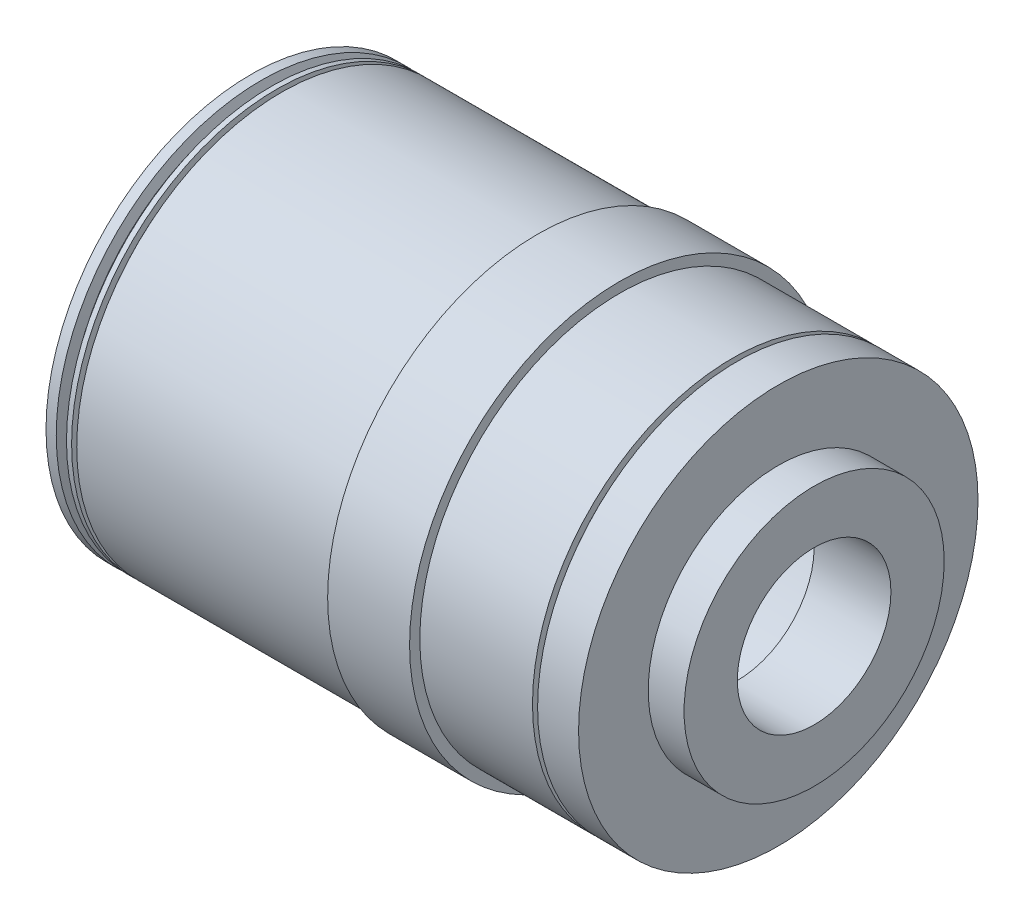
ISO-10303-21;
HEADER;
FILE_DESCRIPTION(('STEP AP214'),'2;1');
FILE_NAME('part.step','',(''),(''),'','','');
FILE_SCHEMA(('AUTOMOTIVE_DESIGN { 1 0 10303 214 1 1 1 1 }'));
ENDSEC;
DATA;
#1=APPLICATION_CONTEXT('core data for automotive mechanical design processes');
#2=APPLICATION_PROTOCOL_DEFINITION('international standard','automotive_design',2000,#1);
#3=PRODUCT_CONTEXT('',#1,'mechanical');
#4=PRODUCT('Part','Part','',(#3));
#5=PRODUCT_RELATED_PRODUCT_CATEGORY('part','',(#4));
#6=PRODUCT_DEFINITION_FORMATION('','',#4);
#7=PRODUCT_DEFINITION_CONTEXT('part definition',#1,'design');
#8=PRODUCT_DEFINITION('design','',#6,#7);
#9=PRODUCT_DEFINITION_SHAPE('','',#8);
#10=(LENGTH_UNIT() NAMED_UNIT(*) SI_UNIT(.MILLI.,.METRE.));
#11=(NAMED_UNIT(*) PLANE_ANGLE_UNIT() SI_UNIT($,.RADIAN.));
#12=(NAMED_UNIT(*) SI_UNIT($,.STERADIAN.) SOLID_ANGLE_UNIT());
#13=UNCERTAINTY_MEASURE_WITH_UNIT(LENGTH_MEASURE(1.E-05),#10,'distance_accuracy_value','');
#14=(GEOMETRIC_REPRESENTATION_CONTEXT(3) GLOBAL_UNCERTAINTY_ASSIGNED_CONTEXT((#13)) GLOBAL_UNIT_ASSIGNED_CONTEXT((#10,
#11,#12)) REPRESENTATION_CONTEXT('',''));
#15=CARTESIAN_POINT('',(0.,0.,0.));
#16=DIRECTION('',(0.,0.,1.));
#17=DIRECTION('',(1.,0.,0.));
#18=AXIS2_PLACEMENT_3D('',#15,#16,#17);
#19=CARTESIAN_POINT('',(-11.5,0.,0.));
#20=DIRECTION('',(1.,0.,0.));
#21=DIRECTION('',(0.,0.,-1.));
#22=AXIS2_PLACEMENT_3D('',#19,#20,#21);
#23=CYLINDRICAL_SURFACE('',#22,17.);
#24=CARTESIAN_POINT('',(0.,0.,0.));
#25=DIRECTION('',(-1.,0.,0.));
#26=DIRECTION('',(0.,0.,1.));
#27=AXIS2_PLACEMENT_3D('',#24,#25,#26);
#28=CIRCLE('',#27,17.);
#29=CARTESIAN_POINT('',(0.,0.,17.));
#30=VERTEX_POINT('',#29);
#31=EDGE_CURVE('E117',#30,#30,#28,.T.);
#32=ORIENTED_EDGE('',*,*,#31,.F.);
#33=EDGE_LOOP('',(#32));
#34=FACE_BOUND('',#33,.T.);
#35=CARTESIAN_POINT('',(-14.5,0.,0.));
#36=DIRECTION('',(-1.,0.,0.));
#37=DIRECTION('',(0.,0.,1.));
#38=AXIS2_PLACEMENT_3D('',#35,#36,#37);
#39=CIRCLE('',#38,17.);
#40=CARTESIAN_POINT('',(-14.5,0.,17.));
#41=VERTEX_POINT('',#40);
#42=EDGE_CURVE('E53',#41,#41,#39,.T.);
#43=ORIENTED_EDGE('',*,*,#42,.T.);
#44=EDGE_LOOP('',(#43));
#45=FACE_BOUND('',#44,.T.);
#46=ADVANCED_FACE('F36',(#34,#45),#23,.F.);
#47=CARTESIAN_POINT('',(4.,0.,0.));
#48=DIRECTION('',(1.,0.,0.));
#49=DIRECTION('',(0.,0.,-1.));
#50=AXIS2_PLACEMENT_3D('',#47,#48,#49);
#51=PLANE('',#50);
#52=CARTESIAN_POINT('',(4.,0.,0.));
#53=DIRECTION('',(1.,0.,0.));
#54=DIRECTION('',(0.,0.,-1.));
#55=AXIS2_PLACEMENT_3D('',#52,#53,#54);
#56=CIRCLE('',#55,19.5);
#57=CARTESIAN_POINT('',(4.,0.,-19.5));
#58=VERTEX_POINT('',#57);
#59=EDGE_CURVE('E40',#58,#58,#56,.T.);
#60=ORIENTED_EDGE('',*,*,#59,.T.);
#61=EDGE_LOOP('',(#60));
#62=FACE_BOUND('',#61,.T.);
#63=CARTESIAN_POINT('',(4.,0.,0.));
#64=DIRECTION('',(1.,0.,0.));
#65=DIRECTION('',(0.,0.,-1.));
#66=AXIS2_PLACEMENT_3D('',#63,#64,#65);
#67=CIRCLE('',#66,12.7);
#68=CARTESIAN_POINT('',(4.,0.,-12.7));
#69=VERTEX_POINT('',#68);
#70=EDGE_CURVE('E60',#69,#69,#67,.T.);
#71=ORIENTED_EDGE('',*,*,#70,.F.);
#72=EDGE_LOOP('',(#71));
#73=FACE_BOUND('',#72,.T.);
#74=ADVANCED_FACE('F152',(#62,#73),#51,.T.);
#75=CARTESIAN_POINT('',(-47.5,0.,0.));
#76=DIRECTION('',(1.,0.,0.));
#77=DIRECTION('',(0.,0.,-1.));
#78=AXIS2_PLACEMENT_3D('',#75,#76,#77);
#79=CYLINDRICAL_SURFACE('',#78,20.);
#80=CARTESIAN_POINT('',(-45.5,0.,0.));
#81=DIRECTION('',(-1.,0.,0.));
#82=DIRECTION('',(0.,0.,1.));
#83=AXIS2_PLACEMENT_3D('',#80,#81,#82);
#84=CIRCLE('',#83,20.);
#85=CARTESIAN_POINT('',(-45.5,0.,20.));
#86=VERTEX_POINT('',#85);
#87=EDGE_CURVE('E87',#86,#86,#84,.T.);
#88=ORIENTED_EDGE('',*,*,#87,.F.);
#89=EDGE_LOOP('',(#88));
#90=FACE_BOUND('',#89,.T.);
#91=CARTESIAN_POINT('',(-45.,0.,0.));
#92=DIRECTION('',(-1.,0.,0.));
#93=DIRECTION('',(0.,0.,1.));
#94=AXIS2_PLACEMENT_3D('',#91,#92,#93);
#95=CIRCLE('',#94,20.);
#96=CARTESIAN_POINT('',(-45.,0.,20.));
#97=VERTEX_POINT('',#96);
#98=EDGE_CURVE('E69',#97,#97,#95,.T.);
#99=ORIENTED_EDGE('',*,*,#98,.T.);
#100=EDGE_LOOP('',(#99));
#101=FACE_BOUND('',#100,.T.);
#102=ADVANCED_FACE('F158',(#90,#101),#79,.T.);
#103=CARTESIAN_POINT('',(-47.5,0.,0.));
#104=DIRECTION('',(-1.,0.,0.));
#105=DIRECTION('',(0.,0.,1.));
#106=AXIS2_PLACEMENT_3D('',#103,#104,#105);
#107=CIRCLE('',#106,20.);
#108=CARTESIAN_POINT('',(-47.5,0.,20.));
#109=VERTEX_POINT('',#108);
#110=EDGE_CURVE('E94',#109,#109,#107,.T.);
#111=ORIENTED_EDGE('',*,*,#110,.F.);
#112=EDGE_LOOP('',(#111));
#113=FACE_BOUND('',#112,.T.);
#114=CARTESIAN_POINT('',(-46.5,0.,0.));
#115=DIRECTION('',(-1.,0.,0.));
#116=DIRECTION('',(0.,0.,1.));
#117=AXIS2_PLACEMENT_3D('',#114,#115,#116);
#118=CIRCLE('',#117,20.);
#119=CARTESIAN_POINT('',(-46.5,0.,20.));
#120=VERTEX_POINT('',#119);
#121=EDGE_CURVE('E84',#120,#120,#118,.T.);
#122=ORIENTED_EDGE('',*,*,#121,.T.);
#123=EDGE_LOOP('',(#122));
#124=FACE_BOUND('',#123,.T.);
#125=ADVANCED_FACE('F183',(#113,#124),#79,.T.);
#126=CARTESIAN_POINT('',(4.,0.,0.));
#127=DIRECTION('',(-1.,0.,0.));
#128=DIRECTION('',(0.,0.,1.));
#129=AXIS2_PLACEMENT_3D('',#126,#127,#128);
#130=CYLINDRICAL_SURFACE('',#129,19.5);
#131=ORIENTED_EDGE('',*,*,#59,.F.);
#132=EDGE_LOOP('',(#131));
#133=FACE_BOUND('',#132,.T.);
#134=CARTESIAN_POINT('',(0.,0.,0.));
#135=DIRECTION('',(-1.,0.,0.));
#136=DIRECTION('',(0.,0.,1.));
#137=AXIS2_PLACEMENT_3D('',#134,#135,#136);
#138=CIRCLE('',#137,19.5);
#139=CARTESIAN_POINT('',(0.,0.,19.5));
#140=VERTEX_POINT('',#139);
#141=EDGE_CURVE('E114',#140,#140,#138,.T.);
#142=ORIENTED_EDGE('',*,*,#141,.F.);
#143=EDGE_LOOP('',(#142));
#144=FACE_BOUND('',#143,.T.);
#145=ADVANCED_FACE('F38',(#133,#144),#130,.T.);
#146=CARTESIAN_POINT('',(-11.5,0.,0.));
#147=DIRECTION('',(-1.,0.,0.));
#148=DIRECTION('',(0.,0.,1.));
#149=AXIS2_PLACEMENT_3D('',#146,#147,#148);
#150=CIRCLE('',#149,19.5);
#151=CARTESIAN_POINT('',(-11.5,0.,19.5));
#152=VERTEX_POINT('',#151);
#153=EDGE_CURVE('E120',#152,#152,#150,.T.);
#154=ORIENTED_EDGE('',*,*,#153,.F.);
#155=EDGE_LOOP('',(#154));
#156=FACE_BOUND('',#155,.T.);
#157=CARTESIAN_POINT('',(-0.5,0.,0.));
#158=DIRECTION('',(-1.,0.,0.));
#159=DIRECTION('',(0.,0.,1.));
#160=AXIS2_PLACEMENT_3D('',#157,#158,#159);
#161=CIRCLE('',#160,19.5);
#162=CARTESIAN_POINT('',(-0.5,0.,19.5));
#163=VERTEX_POINT('',#162);
#164=EDGE_CURVE('E111',#163,#163,#161,.T.);
#165=ORIENTED_EDGE('',*,*,#164,.T.);
#166=EDGE_LOOP('',(#165));
#167=FACE_BOUND('',#166,.T.);
#168=ADVANCED_FACE('F231',(#156,#167),#130,.T.);
#169=CARTESIAN_POINT('',(0.,0.,0.));
#170=DIRECTION('',(1.,0.,0.));
#171=DIRECTION('',(0.,0.,-1.));
#172=AXIS2_PLACEMENT_3D('',#169,#170,#171);
#173=PLANE('',#172);
#174=ORIENTED_EDGE('',*,*,#31,.T.);
#175=EDGE_LOOP('',(#174));
#176=FACE_BOUND('',#175,.T.);
#177=CARTESIAN_POINT('',(0.,0.,0.));
#178=DIRECTION('',(1.,0.,0.));
#179=DIRECTION('',(0.,0.,-1.));
#180=AXIS2_PLACEMENT_3D('',#177,#178,#179);
#181=CIRCLE('',#180,7.5);
#182=CARTESIAN_POINT('',(0.,0.,-7.5));
#183=VERTEX_POINT('',#182);
#184=EDGE_CURVE('E48',#183,#183,#181,.T.);
#185=ORIENTED_EDGE('',*,*,#184,.T.);
#186=EDGE_LOOP('',(#185));
#187=FACE_BOUND('',#186,.T.);
#188=ADVANCED_FACE('F125',(#176,#187),#173,.F.);
#189=CARTESIAN_POINT('',(4.,0.,0.));
#190=DIRECTION('',(-1.,0.,0.));
#191=DIRECTION('',(0.,0.,1.));
#192=AXIS2_PLACEMENT_3D('',#189,#190,#191);
#193=CYLINDRICAL_SURFACE('',#192,7.5);
#194=ORIENTED_EDGE('',*,*,#184,.F.);
#195=EDGE_LOOP('',(#194));
#196=FACE_BOUND('',#195,.T.);
#197=CARTESIAN_POINT('',(7.5,0.,0.));
#198=DIRECTION('',(1.,0.,0.));
#199=DIRECTION('',(0.,0.,-1.));
#200=AXIS2_PLACEMENT_3D('',#197,#198,#199);
#201=CIRCLE('',#200,7.5);
#202=CARTESIAN_POINT('',(7.5,0.,-7.5));
#203=VERTEX_POINT('',#202);
#204=EDGE_CURVE('E56',#203,#203,#201,.T.);
#205=ORIENTED_EDGE('',*,*,#204,.T.);
#206=EDGE_LOOP('',(#205));
#207=FACE_BOUND('',#206,.T.);
#208=ADVANCED_FACE('F127',(#196,#207),#193,.F.);
#209=CARTESIAN_POINT('',(-19.5,0.,0.));
#210=DIRECTION('',(-1.,0.,0.));
#211=DIRECTION('',(0.,0.,1.));
#212=AXIS2_PLACEMENT_3D('',#209,#210,#211);
#213=CIRCLE('',#212,17.);
#214=CARTESIAN_POINT('',(-19.5,0.,17.));
#215=VERTEX_POINT('',#214);
#216=EDGE_CURVE('E10',#215,#215,#213,.T.);
#217=ORIENTED_EDGE('',*,*,#216,.F.);
#218=EDGE_LOOP('',(#217));
#219=FACE_BOUND('',#218,.T.);
#220=CARTESIAN_POINT('',(-47.5,0.,0.));
#221=DIRECTION('',(-1.,0.,0.));
#222=DIRECTION('',(0.,0.,1.));
#223=AXIS2_PLACEMENT_3D('',#220,#221,#222);
#224=CIRCLE('',#223,17.);
#225=CARTESIAN_POINT('',(-47.5,0.,17.));
#226=VERTEX_POINT('',#225);
#227=EDGE_CURVE('E91',#226,#226,#224,.F.);
#228=ORIENTED_EDGE('',*,*,#227,.F.);
#229=EDGE_LOOP('',(#228));
#230=FACE_BOUND('',#229,.T.);
#231=ADVANCED_FACE('F130',(#219,#230),#23,.F.);
#232=CARTESIAN_POINT('',(0.,18.8,0.));
#233=DIRECTION('',(-1.,0.,0.));
#234=DIRECTION('',(0.,0.,1.));
#235=AXIS2_PLACEMENT_3D('',#232,#233,#234);
#236=PLANE('',#235);
#237=ORIENTED_EDGE('',*,*,#141,.T.);
#238=EDGE_LOOP('',(#237));
#239=FACE_BOUND('',#238,.T.);
#240=CARTESIAN_POINT('',(0.,0.,0.));
#241=DIRECTION('',(-1.,0.,0.));
#242=DIRECTION('',(0.,0.,1.));
#243=AXIS2_PLACEMENT_3D('',#240,#241,#242);
#244=CIRCLE('',#243,18.8);
#245=CARTESIAN_POINT('',(0.,0.,18.8));
#246=VERTEX_POINT('',#245);
#247=EDGE_CURVE('E103',#246,#246,#244,.T.);
#248=ORIENTED_EDGE('',*,*,#247,.F.);
#249=EDGE_LOOP('',(#248));
#250=FACE_BOUND('',#249,.T.);
#251=ADVANCED_FACE('F165',(#239,#250),#236,.T.);
#252=CARTESIAN_POINT('',(-0.5,19.5,0.));
#253=DIRECTION('',(1.,0.,0.));
#254=DIRECTION('',(0.,0.,-1.));
#255=AXIS2_PLACEMENT_3D('',#252,#253,#254);
#256=PLANE('',#255);
#257=CARTESIAN_POINT('',(-0.5,0.,0.));
#258=DIRECTION('',(-1.,0.,0.));
#259=DIRECTION('',(0.,0.,1.));
#260=AXIS2_PLACEMENT_3D('',#257,#258,#259);
#261=CIRCLE('',#260,18.8);
#262=CARTESIAN_POINT('',(-0.5,0.,18.8));
#263=VERTEX_POINT('',#262);
#264=EDGE_CURVE('E108',#263,#263,#261,.T.);
#265=ORIENTED_EDGE('',*,*,#264,.T.);
#266=EDGE_LOOP('',(#265));
#267=FACE_BOUND('',#266,.T.);
#268=ORIENTED_EDGE('',*,*,#164,.F.);
#269=EDGE_LOOP('',(#268));
#270=FACE_BOUND('',#269,.T.);
#271=ADVANCED_FACE('F170',(#267,#270),#256,.T.);
#272=CARTESIAN_POINT('',(-11.5,0.,0.));
#273=DIRECTION('',(-1.,0.,0.));
#274=DIRECTION('',(0.,0.,1.));
#275=AXIS2_PLACEMENT_3D('',#272,#273,#274);
#276=CYLINDRICAL_SURFACE('',#275,18.8);
#277=ORIENTED_EDGE('',*,*,#247,.T.);
#278=EDGE_LOOP('',(#277));
#279=FACE_BOUND('',#278,.T.);
#280=ORIENTED_EDGE('',*,*,#264,.F.);
#281=EDGE_LOOP('',(#280));
#282=FACE_BOUND('',#281,.T.);
#283=ADVANCED_FACE('F215',(#279,#282),#276,.T.);
#284=CARTESIAN_POINT('',(-11.5,0.,0.));
#285=DIRECTION('',(-1.,0.,0.));
#286=DIRECTION('',(0.,0.,1.));
#287=AXIS2_PLACEMENT_3D('',#284,#285,#286);
#288=PLANE('',#287);
#289=CARTESIAN_POINT('',(-11.5,0.,0.));
#290=DIRECTION('',(-1.,0.,0.));
#291=DIRECTION('',(0.,0.,1.));
#292=AXIS2_PLACEMENT_3D('',#289,#290,#291);
#293=CIRCLE('',#292,20.5);
#294=CARTESIAN_POINT('',(-11.5,0.,20.5));
#295=VERTEX_POINT('',#294);
#296=EDGE_CURVE('E97',#295,#295,#293,.T.);
#297=ORIENTED_EDGE('',*,*,#296,.F.);
#298=EDGE_LOOP('',(#297));
#299=FACE_BOUND('',#298,.T.);
#300=ORIENTED_EDGE('',*,*,#153,.T.);
#301=EDGE_LOOP('',(#300));
#302=FACE_BOUND('',#301,.T.);
#303=ADVANCED_FACE('F211',(#299,#302),#288,.F.);
#304=CARTESIAN_POINT('',(-19.5,0.,0.));
#305=DIRECTION('',(-1.,0.,0.));
#306=DIRECTION('',(0.,0.,1.));
#307=AXIS2_PLACEMENT_3D('',#304,#305,#306);
#308=PLANE('',#307);
#309=CARTESIAN_POINT('',(-19.5,0.,0.));
#310=DIRECTION('',(-1.,0.,0.));
#311=DIRECTION('',(0.,0.,1.));
#312=AXIS2_PLACEMENT_3D('',#309,#310,#311);
#313=CIRCLE('',#312,20.);
#314=CARTESIAN_POINT('',(-19.5,0.,20.));
#315=VERTEX_POINT('',#314);
#316=EDGE_CURVE('E90',#315,#315,#313,.T.);
#317=ORIENTED_EDGE('',*,*,#316,.F.);
#318=EDGE_LOOP('',(#317));
#319=FACE_BOUND('',#318,.T.);
#320=CARTESIAN_POINT('',(-19.5,0.,0.));
#321=DIRECTION('',(-1.,0.,0.));
#322=DIRECTION('',(0.,0.,1.));
#323=AXIS2_PLACEMENT_3D('',#320,#321,#322);
#324=CIRCLE('',#323,20.5);
#325=CARTESIAN_POINT('',(-19.5,0.,20.5));
#326=VERTEX_POINT('',#325);
#327=EDGE_CURVE('E100',#326,#326,#324,.T.);
#328=ORIENTED_EDGE('',*,*,#327,.T.);
#329=EDGE_LOOP('',(#328));
#330=FACE_BOUND('',#329,.T.);
#331=ADVANCED_FACE('F208',(#319,#330),#308,.T.);
#332=CARTESIAN_POINT('',(-19.5,0.,0.));
#333=DIRECTION('',(1.,0.,0.));
#334=DIRECTION('',(0.,0.,-1.));
#335=AXIS2_PLACEMENT_3D('',#332,#333,#334);
#336=CYLINDRICAL_SURFACE('',#335,20.5);
#337=ORIENTED_EDGE('',*,*,#327,.F.);
#338=EDGE_LOOP('',(#337));
#339=FACE_BOUND('',#338,.T.);
#340=ORIENTED_EDGE('',*,*,#296,.T.);
#341=EDGE_LOOP('',(#340));
#342=FACE_BOUND('',#341,.T.);
#343=ADVANCED_FACE('F206',(#339,#342),#336,.T.);
#344=CARTESIAN_POINT('',(-44.5,0.,0.));
#345=DIRECTION('',(-1.,0.,0.));
#346=DIRECTION('',(0.,0.,1.));
#347=AXIS2_PLACEMENT_3D('',#344,#345,#346);
#348=CIRCLE('',#347,20.);
#349=CARTESIAN_POINT('',(-44.5,0.,20.));
#350=VERTEX_POINT('',#349);
#351=EDGE_CURVE('E72',#350,#350,#348,.T.);
#352=ORIENTED_EDGE('',*,*,#351,.F.);
#353=EDGE_LOOP('',(#352));
#354=FACE_BOUND('',#353,.T.);
#355=ORIENTED_EDGE('',*,*,#316,.T.);
#356=EDGE_LOOP('',(#355));
#357=FACE_BOUND('',#356,.T.);
#358=ADVANCED_FACE('F179',(#354,#357),#79,.T.);
#359=CARTESIAN_POINT('',(-47.5,0.,0.));
#360=DIRECTION('',(-1.,0.,0.));
#361=DIRECTION('',(0.,0.,1.));
#362=AXIS2_PLACEMENT_3D('',#359,#360,#361);
#363=PLANE('',#362);
#364=ORIENTED_EDGE('',*,*,#227,.T.);
#365=EDGE_LOOP('',(#364));
#366=FACE_BOUND('',#365,.T.);
#367=ORIENTED_EDGE('',*,*,#110,.T.);
#368=EDGE_LOOP('',(#367));
#369=FACE_BOUND('',#368,.T.);
#370=ADVANCED_FACE('F175',(#366,#369),#363,.T.);
#371=CARTESIAN_POINT('',(-45.5,0.,0.));
#372=DIRECTION('',(1.,0.,0.));
#373=DIRECTION('',(0.,0.,-1.));
#374=AXIS2_PLACEMENT_3D('',#371,#372,#373);
#375=CONICAL_SURFACE('',#374,20.,1.18018928309722);
#376=CARTESIAN_POINT('',(-45.85,0.,0.));
#377=DIRECTION('',(-1.,0.,0.));
#378=DIRECTION('',(0.,0.,1.));
#379=AXIS2_PLACEMENT_3D('',#376,#377,#378);
#380=CIRCLE('',#379,19.15);
#381=CARTESIAN_POINT('',(-45.85,0.,19.15));
#382=VERTEX_POINT('',#381);
#383=EDGE_CURVE('E78',#382,#382,#380,.T.);
#384=ORIENTED_EDGE('',*,*,#383,.F.);
#385=EDGE_LOOP('',(#384));
#386=FACE_BOUND('',#385,.T.);
#387=ORIENTED_EDGE('',*,*,#87,.T.);
#388=EDGE_LOOP('',(#387));
#389=FACE_BOUND('',#388,.T.);
#390=ADVANCED_FACE('F178',(#386,#389),#375,.T.);
#391=CARTESIAN_POINT('',(-46.5,0.,0.));
#392=DIRECTION('',(-1.,0.,0.));
#393=DIRECTION('',(0.,0.,1.));
#394=AXIS2_PLACEMENT_3D('',#391,#392,#393);
#395=CONICAL_SURFACE('',#394,20.,1.18018928309721);
#396=CARTESIAN_POINT('',(-46.15,0.,0.));
#397=DIRECTION('',(-1.,0.,0.));
#398=DIRECTION('',(0.,0.,1.));
#399=AXIS2_PLACEMENT_3D('',#396,#397,#398);
#400=CIRCLE('',#399,19.15);
#401=CARTESIAN_POINT('',(-46.15,0.,19.15));
#402=VERTEX_POINT('',#401);
#403=EDGE_CURVE('E81',#402,#402,#400,.T.);
#404=ORIENTED_EDGE('',*,*,#403,.T.);
#405=EDGE_LOOP('',(#404));
#406=FACE_BOUND('',#405,.T.);
#407=ORIENTED_EDGE('',*,*,#121,.F.);
#408=EDGE_LOOP('',(#407));
#409=FACE_BOUND('',#408,.T.);
#410=ADVANCED_FACE('F189',(#406,#409),#395,.T.);
#411=CARTESIAN_POINT('',(-11.5,0.,0.));
#412=DIRECTION('',(-1.,0.,0.));
#413=DIRECTION('',(0.,0.,1.));
#414=AXIS2_PLACEMENT_3D('',#411,#412,#413);
#415=CYLINDRICAL_SURFACE('',#414,19.15);
#416=ORIENTED_EDGE('',*,*,#403,.F.);
#417=EDGE_LOOP('',(#416));
#418=FACE_BOUND('',#417,.T.);
#419=ORIENTED_EDGE('',*,*,#383,.T.);
#420=EDGE_LOOP('',(#419));
#421=FACE_BOUND('',#420,.T.);
#422=ADVANCED_FACE('F191',(#418,#421),#415,.T.);
#423=CARTESIAN_POINT('',(-11.5,0.,0.));
#424=DIRECTION('',(-1.,0.,0.));
#425=DIRECTION('',(0.,0.,1.));
#426=AXIS2_PLACEMENT_3D('',#423,#424,#425);
#427=CYLINDRICAL_SURFACE('',#426,19.3);
#428=CARTESIAN_POINT('',(-45.,0.,0.));
#429=DIRECTION('',(-1.,0.,0.));
#430=DIRECTION('',(0.,0.,1.));
#431=AXIS2_PLACEMENT_3D('',#428,#429,#430);
#432=CIRCLE('',#431,19.3);
#433=CARTESIAN_POINT('',(-45.,0.,19.3));
#434=VERTEX_POINT('',#433);
#435=EDGE_CURVE('E64',#434,#434,#432,.T.);
#436=ORIENTED_EDGE('',*,*,#435,.F.);
#437=EDGE_LOOP('',(#436));
#438=FACE_BOUND('',#437,.T.);
#439=CARTESIAN_POINT('',(-44.5,0.,0.));
#440=DIRECTION('',(-1.,0.,0.));
#441=DIRECTION('',(0.,0.,1.));
#442=AXIS2_PLACEMENT_3D('',#439,#440,#441);
#443=CIRCLE('',#442,19.3);
#444=CARTESIAN_POINT('',(-44.5,0.,19.3));
#445=VERTEX_POINT('',#444);
#446=EDGE_CURVE('E75',#445,#445,#443,.T.);
#447=ORIENTED_EDGE('',*,*,#446,.T.);
#448=EDGE_LOOP('',(#447));
#449=FACE_BOUND('',#448,.T.);
#450=ADVANCED_FACE('F198',(#438,#449),#427,.T.);
#451=CARTESIAN_POINT('',(-44.5,0.,0.));
#452=DIRECTION('',(1.,0.,0.));
#453=DIRECTION('',(0.,0.,-1.));
#454=AXIS2_PLACEMENT_3D('',#451,#452,#453);
#455=PLANE('',#454);
#456=ORIENTED_EDGE('',*,*,#446,.F.);
#457=EDGE_LOOP('',(#456));
#458=FACE_BOUND('',#457,.T.);
#459=ORIENTED_EDGE('',*,*,#351,.T.);
#460=EDGE_LOOP('',(#459));
#461=FACE_BOUND('',#460,.T.);
#462=ADVANCED_FACE('F147',(#458,#461),#455,.F.);
#463=CARTESIAN_POINT('',(-45.,0.,0.));
#464=DIRECTION('',(1.,0.,0.));
#465=DIRECTION('',(0.,0.,-1.));
#466=AXIS2_PLACEMENT_3D('',#463,#464,#465);
#467=PLANE('',#466);
#468=ORIENTED_EDGE('',*,*,#435,.T.);
#469=EDGE_LOOP('',(#468));
#470=FACE_BOUND('',#469,.T.);
#471=ORIENTED_EDGE('',*,*,#98,.F.);
#472=EDGE_LOOP('',(#471));
#473=FACE_BOUND('',#472,.T.);
#474=ADVANCED_FACE('F137',(#470,#473),#467,.T.);
#475=CARTESIAN_POINT('',(7.5,0.,0.));
#476=DIRECTION('',(1.,0.,0.));
#477=DIRECTION('',(0.,0.,-1.));
#478=AXIS2_PLACEMENT_3D('',#475,#476,#477);
#479=PLANE('',#478);
#480=CARTESIAN_POINT('',(7.5,0.,0.));
#481=DIRECTION('',(1.,0.,0.));
#482=DIRECTION('',(0.,0.,-1.));
#483=AXIS2_PLACEMENT_3D('',#480,#481,#482);
#484=CIRCLE('',#483,12.7);
#485=CARTESIAN_POINT('',(7.5,0.,-12.7));
#486=VERTEX_POINT('',#485);
#487=EDGE_CURVE('E61',#486,#486,#484,.T.);
#488=ORIENTED_EDGE('',*,*,#487,.T.);
#489=EDGE_LOOP('',(#488));
#490=FACE_BOUND('',#489,.T.);
#491=ORIENTED_EDGE('',*,*,#204,.F.);
#492=EDGE_LOOP('',(#491));
#493=FACE_BOUND('',#492,.T.);
#494=ADVANCED_FACE('F134',(#490,#493),#479,.T.);
#495=CARTESIAN_POINT('',(7.5,0.,0.));
#496=DIRECTION('',(-1.,0.,0.));
#497=DIRECTION('',(0.,0.,1.));
#498=AXIS2_PLACEMENT_3D('',#495,#496,#497);
#499=CYLINDRICAL_SURFACE('',#498,12.7);
#500=ORIENTED_EDGE('',*,*,#487,.F.);
#501=EDGE_LOOP('',(#500));
#502=FACE_BOUND('',#501,.T.);
#503=ORIENTED_EDGE('',*,*,#70,.T.);
#504=EDGE_LOOP('',(#503));
#505=FACE_BOUND('',#504,.T.);
#506=ADVANCED_FACE('F136',(#502,#505),#499,.T.);
#507=CARTESIAN_POINT('',(-19.5,0.,0.));
#508=DIRECTION('',(-1.,0.,0.));
#509=DIRECTION('',(0.,0.,1.));
#510=AXIS2_PLACEMENT_3D('',#507,#508,#509);
#511=PLANE('',#510);
#512=CARTESIAN_POINT('',(-19.5,0.,0.));
#513=DIRECTION('',(-1.,0.,0.));
#514=DIRECTION('',(0.,0.,1.));
#515=AXIS2_PLACEMENT_3D('',#512,#513,#514);
#516=CIRCLE('',#515,3.);
#517=CARTESIAN_POINT('',(-19.5,0.,3.));
#518=VERTEX_POINT('',#517);
#519=EDGE_CURVE('E51',#518,#518,#516,.T.);
#520=ORIENTED_EDGE('',*,*,#519,.F.);
#521=EDGE_LOOP('',(#520));
#522=FACE_BOUND('',#521,.T.);
#523=ORIENTED_EDGE('',*,*,#216,.T.);
#524=EDGE_LOOP('',(#523));
#525=FACE_BOUND('',#524,.T.);
#526=ADVANCED_FACE('F144',(#522,#525),#511,.T.);
#527=CARTESIAN_POINT('',(-14.5,0.,0.));
#528=DIRECTION('',(-1.,0.,0.));
#529=DIRECTION('',(0.,0.,1.));
#530=AXIS2_PLACEMENT_3D('',#527,#528,#529);
#531=PLANE('',#530);
#532=ORIENTED_EDGE('',*,*,#42,.F.);
#533=EDGE_LOOP('',(#532));
#534=FACE_BOUND('',#533,.T.);
#535=CARTESIAN_POINT('',(-14.5,0.,0.));
#536=DIRECTION('',(-1.,0.,0.));
#537=DIRECTION('',(0.,0.,1.));
#538=AXIS2_PLACEMENT_3D('',#535,#536,#537);
#539=CIRCLE('',#538,3.);
#540=CARTESIAN_POINT('',(-14.5,0.,3.));
#541=VERTEX_POINT('',#540);
#542=EDGE_CURVE('E57',#541,#541,#539,.T.);
#543=ORIENTED_EDGE('',*,*,#542,.T.);
#544=EDGE_LOOP('',(#543));
#545=FACE_BOUND('',#544,.T.);
#546=ADVANCED_FACE('F319',(#534,#545),#531,.F.);
#547=CARTESIAN_POINT('',(-14.5,0.,0.));
#548=DIRECTION('',(-1.,0.,0.));
#549=DIRECTION('',(0.,0.,1.));
#550=AXIS2_PLACEMENT_3D('',#547,#548,#549);
#551=CYLINDRICAL_SURFACE('',#550,3.);
#552=ORIENTED_EDGE('',*,*,#542,.F.);
#553=EDGE_LOOP('',(#552));
#554=FACE_BOUND('',#553,.T.);
#555=ORIENTED_EDGE('',*,*,#519,.T.);
#556=EDGE_LOOP('',(#555));
#557=FACE_BOUND('',#556,.T.);
#558=ADVANCED_FACE('F328',(#554,#557),#551,.F.);
#559=CLOSED_SHELL('',(#46,#74,#102,#125,#145,#168,#188,#208,#231,#251,#271,#283,#303,#331,#343,
#358,#370,#390,#410,#422,#450,#462,#474,#494,#506,#526,#546,#558));
#560=MANIFOLD_SOLID_BREP('B2',#559);
#561=ADVANCED_BREP_SHAPE_REPRESENTATION('',(#18,#560),#14);
#562=SHAPE_DEFINITION_REPRESENTATION(#9,#561);
ENDSEC;
END-ISO-10303-21;
